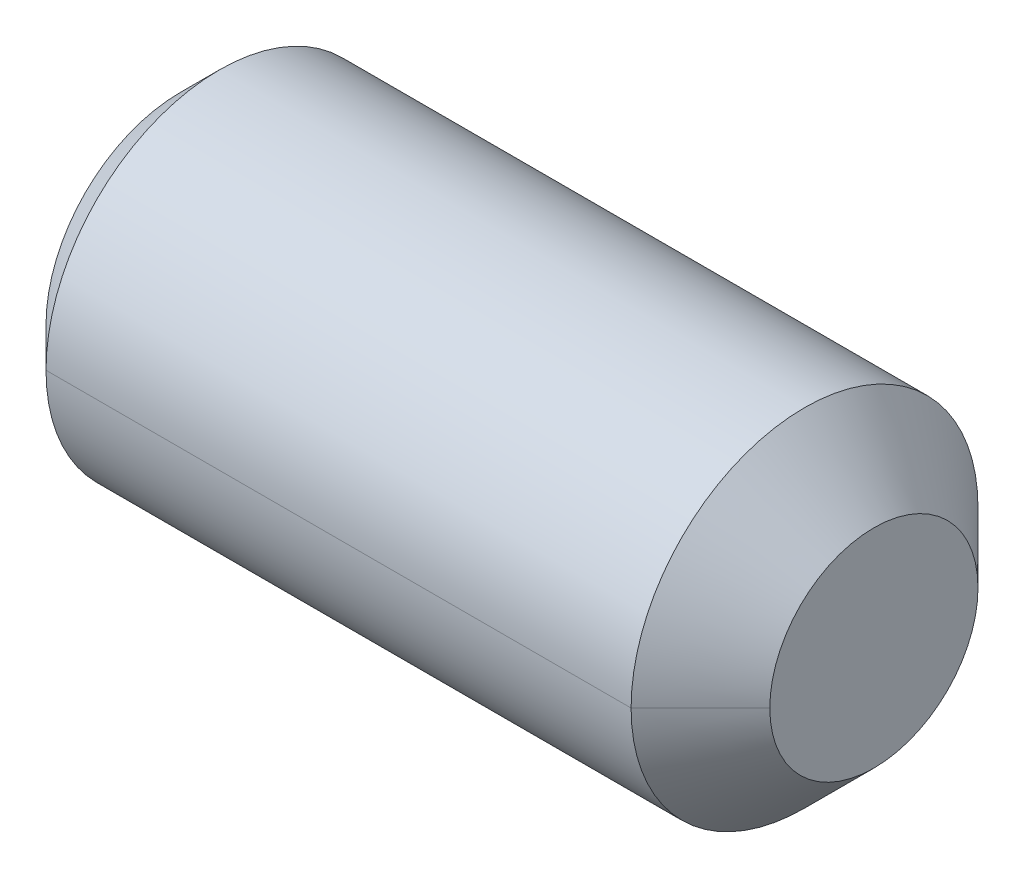
ISO-10303-21;
HEADER;
FILE_DESCRIPTION(('STEP AP214'),'2;1');
FILE_NAME('part.step','',(''),(''),'','','');
FILE_SCHEMA(('AUTOMOTIVE_DESIGN { 1 0 10303 214 1 1 1 1 }'));
ENDSEC;
DATA;
#1=APPLICATION_CONTEXT('core data for automotive mechanical design processes');
#2=APPLICATION_PROTOCOL_DEFINITION('international standard','automotive_design',2000,#1);
#3=PRODUCT_CONTEXT('',#1,'mechanical');
#4=PRODUCT('Part','Part','',(#3));
#5=PRODUCT_RELATED_PRODUCT_CATEGORY('part','',(#4));
#6=PRODUCT_DEFINITION_FORMATION('','',#4);
#7=PRODUCT_DEFINITION_CONTEXT('part definition',#1,'design');
#8=PRODUCT_DEFINITION('design','',#6,#7);
#9=PRODUCT_DEFINITION_SHAPE('','',#8);
#10=(LENGTH_UNIT() NAMED_UNIT(*) SI_UNIT(.MILLI.,.METRE.));
#11=(NAMED_UNIT(*) PLANE_ANGLE_UNIT() SI_UNIT($,.RADIAN.));
#12=(NAMED_UNIT(*) SI_UNIT($,.STERADIAN.) SOLID_ANGLE_UNIT());
#13=UNCERTAINTY_MEASURE_WITH_UNIT(LENGTH_MEASURE(1.E-05),#10,'distance_accuracy_value','');
#14=(GEOMETRIC_REPRESENTATION_CONTEXT(3) GLOBAL_UNCERTAINTY_ASSIGNED_CONTEXT((#13)) GLOBAL_UNIT_ASSIGNED_CONTEXT((#10,
#11,#12)) REPRESENTATION_CONTEXT('',''));
#15=CARTESIAN_POINT('',(0.,0.,0.));
#16=DIRECTION('',(0.,0.,1.));
#17=DIRECTION('',(1.,0.,0.));
#18=AXIS2_PLACEMENT_3D('',#15,#16,#17);
#19=CARTESIAN_POINT('',(-6.4212,0.,0.));
#20=DIRECTION('',(-1.,0.,0.));
#21=DIRECTION('',(0.,1.,0.));
#22=AXIS2_PLACEMENT_3D('',#19,#20,#21);
#23=CONICAL_SURFACE('',#22,0.992,1.0471975512);
#24=CARTESIAN_POINT('',(-5.84846853296839,0.,0.));
#25=DIRECTION('',(-0.499999999997054,0.,-0.86602540378614));
#26=VECTOR('',#25,1.);
#27=LINE('',#24,#26);
#28=CARTESIAN_POINT('',(-5.8484685329639,0.,0.));
#29=VERTEX_POINT('',#28);
#30=CARTESIAN_POINT('',(-6.4212,0.,-0.992));
#31=VERTEX_POINT('',#30);
#32=EDGE_CURVE('E11',#29,#31,#27,.T.);
#33=ORIENTED_EDGE('',*,*,#32,.T.);
#34=CARTESIAN_POINT('',(-6.4212,0.,0.));
#35=DIRECTION('',(1.,0.,0.));
#36=DIRECTION('',(0.,0.,-1.));
#37=AXIS2_PLACEMENT_3D('',#34,#35,#36);
#38=CIRCLE('',#37,0.992);
#39=CARTESIAN_POINT('',(-6.4212,-0.85909720055417,-0.495999999999988));
#40=VERTEX_POINT('',#39);
#41=EDGE_CURVE('E25',#40,#31,#38,.T.);
#42=ORIENTED_EDGE('',*,*,#41,.F.);
#43=CARTESIAN_POINT('',(-6.4212,0.,0.));
#44=DIRECTION('',(1.,0.,0.));
#45=DIRECTION('',(0.,0.,-1.));
#46=AXIS2_PLACEMENT_3D('',#43,#44,#45);
#47=CIRCLE('',#46,0.992);
#48=CARTESIAN_POINT('',(-6.4212,-0.85909720055417,0.495999999999988));
#49=VERTEX_POINT('',#48);
#50=EDGE_CURVE('E451',#49,#40,#47,.T.);
#51=ORIENTED_EDGE('',*,*,#50,.F.);
#52=CARTESIAN_POINT('',(-6.4212,0.,0.));
#53=DIRECTION('',(1.,0.,0.));
#54=DIRECTION('',(0.,0.,-1.));
#55=AXIS2_PLACEMENT_3D('',#52,#53,#54);
#56=CIRCLE('',#55,0.992);
#57=CARTESIAN_POINT('',(-6.4212,0.,0.992));
#58=VERTEX_POINT('',#57);
#59=EDGE_CURVE('E448',#58,#49,#56,.T.);
#60=ORIENTED_EDGE('',*,*,#59,.F.);
#61=CARTESIAN_POINT('',(-5.84846853296839,0.,0.));
#62=DIRECTION('',(-0.499999999997054,0.,0.86602540378614));
#63=VECTOR('',#62,1.);
#64=LINE('',#61,#63);
#65=EDGE_CURVE('E438',#29,#58,#64,.T.);
#66=ORIENTED_EDGE('',*,*,#65,.F.);
#67=EDGE_LOOP('',(#33,#42,#51,#60,#66));
#68=FACE_BOUND('',#67,.T.);
#69=ADVANCED_FACE('F17',(#68),#23,.F.);
#70=CARTESIAN_POINT('',(-6.4212,0.,0.));
#71=DIRECTION('',(-1.,0.,0.));
#72=DIRECTION('',(0.,-1.,0.));
#73=AXIS2_PLACEMENT_3D('',#70,#71,#72);
#74=CONICAL_SURFACE('',#73,0.992,1.0471975512);
#75=ORIENTED_EDGE('',*,*,#65,.T.);
#76=CARTESIAN_POINT('',(-6.4212,0.,0.));
#77=DIRECTION('',(1.,0.,0.));
#78=DIRECTION('',(0.,0.,-1.));
#79=AXIS2_PLACEMENT_3D('',#76,#77,#78);
#80=CIRCLE('',#79,0.992);
#81=CARTESIAN_POINT('',(-6.4212,0.85909720055417,0.495999999999988));
#82=VERTEX_POINT('',#81);
#83=EDGE_CURVE('E490',#82,#58,#80,.T.);
#84=ORIENTED_EDGE('',*,*,#83,.F.);
#85=CARTESIAN_POINT('',(-6.4212,0.,0.));
#86=DIRECTION('',(1.,0.,0.));
#87=DIRECTION('',(0.,0.,-1.));
#88=AXIS2_PLACEMENT_3D('',#85,#86,#87);
#89=CIRCLE('',#88,0.992);
#90=CARTESIAN_POINT('',(-6.4212,0.859097200554164,-0.495999999999984));
#91=VERTEX_POINT('',#90);
#92=EDGE_CURVE('E493',#91,#82,#89,.T.);
#93=ORIENTED_EDGE('',*,*,#92,.F.);
#94=CARTESIAN_POINT('',(-6.4212,0.,0.));
#95=DIRECTION('',(1.,0.,0.));
#96=DIRECTION('',(0.,0.,-1.));
#97=AXIS2_PLACEMENT_3D('',#94,#95,#96);
#98=CIRCLE('',#97,0.992);
#99=EDGE_CURVE('E404',#31,#91,#98,.T.);
#100=ORIENTED_EDGE('',*,*,#99,.F.);
#101=ORIENTED_EDGE('',*,*,#32,.F.);
#102=EDGE_LOOP('',(#75,#84,#93,#100,#101));
#103=FACE_BOUND('',#102,.T.);
#104=ADVANCED_FACE('F411',(#103),#74,.F.);
#105=CARTESIAN_POINT('',(-6.4212,0.,0.));
#106=DIRECTION('',(1.,0.,0.));
#107=DIRECTION('',(0.,0.,-1.));
#108=AXIS2_PLACEMENT_3D('',#105,#106,#107);
#109=PLANE('',#108);
#110=ORIENTED_EDGE('',*,*,#99,.T.);
#111=DIRECTION('',(0.,0.499999999999988,0.866025403784446));
#112=VECTOR('',#111,1.);
#113=CARTESIAN_POINT('',(-6.4212,0.57273146703611,-0.992));
#114=LINE('',#113,#112);
#115=CARTESIAN_POINT('',(-6.4212,0.57273146703611,-0.992));
#116=VERTEX_POINT('',#115);
#117=EDGE_CURVE('E399',#116,#91,#114,.T.);
#118=ORIENTED_EDGE('',*,*,#117,.F.);
#119=DIRECTION('',(0.,1.,0.));
#120=VECTOR('',#119,1.);
#121=CARTESIAN_POINT('',(-6.4212,-0.57273146703611,-0.992));
#122=LINE('',#121,#120);
#123=EDGE_CURVE('E394',#31,#116,#122,.T.);
#124=ORIENTED_EDGE('',*,*,#123,.F.);
#125=EDGE_LOOP('',(#110,#118,#124));
#126=FACE_BOUND('',#125,.T.);
#127=ADVANCED_FACE('F420',(#126),#109,.F.);
#128=CARTESIAN_POINT('',(-6.4212,-0.57273146703611,-0.992));
#129=DIRECTION('',(0.,0.,1.));
#130=DIRECTION('',(1.,0.,0.));
#131=AXIS2_PLACEMENT_3D('',#128,#129,#130);
#132=PLANE('',#131);
#133=DIRECTION('',(0.,1.,0.));
#134=VECTOR('',#133,1.);
#135=CARTESIAN_POINT('',(-8.3312,-0.57273146703611,-0.992));
#136=LINE('',#135,#134);
#137=CARTESIAN_POINT('',(-8.3312,-0.57273146703611,-0.992));
#138=VERTEX_POINT('',#137);
#139=CARTESIAN_POINT('',(-8.3312,0.57273146703611,-0.992));
#140=VERTEX_POINT('',#139);
#141=EDGE_CURVE('E389',#138,#140,#136,.T.);
#142=ORIENTED_EDGE('',*,*,#141,.F.);
#143=DIRECTION('',(-1.,0.,0.));
#144=VECTOR('',#143,1.);
#145=CARTESIAN_POINT('',(-6.4212,-0.57273146703611,-0.992));
#146=LINE('',#145,#144);
#147=CARTESIAN_POINT('',(-6.4212,-0.57273146703611,-0.992));
#148=VERTEX_POINT('',#147);
#149=EDGE_CURVE('E384',#148,#138,#146,.T.);
#150=ORIENTED_EDGE('',*,*,#149,.F.);
#151=DIRECTION('',(0.,1.,0.));
#152=VECTOR('',#151,1.);
#153=CARTESIAN_POINT('',(-6.4212,-0.57273146703611,-0.992));
#154=LINE('',#153,#152);
#155=EDGE_CURVE('E379',#148,#31,#154,.T.);
#156=ORIENTED_EDGE('',*,*,#155,.T.);
#157=ORIENTED_EDGE('',*,*,#123,.T.);
#158=DIRECTION('',(-1.,0.,0.));
#159=VECTOR('',#158,1.);
#160=CARTESIAN_POINT('',(-6.4212,0.57273146703611,-0.992));
#161=LINE('',#160,#159);
#162=EDGE_CURVE('E375',#116,#140,#161,.T.);
#163=ORIENTED_EDGE('',*,*,#162,.T.);
#164=EDGE_LOOP('',(#142,#150,#156,#157,#163));
#165=FACE_BOUND('',#164,.T.);
#166=ADVANCED_FACE('F518',(#165),#132,.T.);
#167=CARTESIAN_POINT('',(-6.4212,0.57273146703611,-0.992));
#168=DIRECTION('',(0.,-0.866025403784446,0.499999999999988));
#169=DIRECTION('',(0.,-0.499999999999988,-0.866025403784446));
#170=AXIS2_PLACEMENT_3D('',#167,#168,#169);
#171=PLANE('',#170);
#172=DIRECTION('',(0.,0.499999999999988,0.866025403784446));
#173=VECTOR('',#172,1.);
#174=CARTESIAN_POINT('',(-8.3312,0.57273146703611,-0.992));
#175=LINE('',#174,#173);
#176=CARTESIAN_POINT('',(-8.3312,1.1454629340722,0.));
#177=VERTEX_POINT('',#176);
#178=EDGE_CURVE('E370',#140,#177,#175,.T.);
#179=ORIENTED_EDGE('',*,*,#178,.F.);
#180=ORIENTED_EDGE('',*,*,#162,.F.);
#181=ORIENTED_EDGE('',*,*,#117,.T.);
#182=DIRECTION('',(0.,0.499999999999988,0.866025403784446));
#183=VECTOR('',#182,1.);
#184=CARTESIAN_POINT('',(-6.4212,0.57273146703611,-0.992));
#185=LINE('',#184,#183);
#186=CARTESIAN_POINT('',(-6.4212,1.1454629340722,0.));
#187=VERTEX_POINT('',#186);
#188=EDGE_CURVE('E366',#91,#187,#185,.T.);
#189=ORIENTED_EDGE('',*,*,#188,.T.);
#190=DIRECTION('',(-1.,0.,0.));
#191=VECTOR('',#190,1.);
#192=CARTESIAN_POINT('',(-6.4212,1.1454629340722,0.));
#193=LINE('',#192,#191);
#194=EDGE_CURVE('E362',#187,#177,#193,.T.);
#195=ORIENTED_EDGE('',*,*,#194,.T.);
#196=EDGE_LOOP('',(#179,#180,#181,#189,#195));
#197=FACE_BOUND('',#196,.T.);
#198=ADVANCED_FACE('F506',(#197),#171,.T.);
#199=CARTESIAN_POINT('',(-6.4212,1.1454629340722,0.));
#200=DIRECTION('',(0.,-0.866025403784446,-0.499999999999988));
#201=DIRECTION('',(0.,0.499999999999988,-0.866025403784446));
#202=AXIS2_PLACEMENT_3D('',#199,#200,#201);
#203=PLANE('',#202);
#204=DIRECTION('',(0.,-0.499999999999988,0.866025403784446));
#205=VECTOR('',#204,1.);
#206=CARTESIAN_POINT('',(-8.3312,1.1454629340722,0.));
#207=LINE('',#206,#205);
#208=CARTESIAN_POINT('',(-8.3312,0.57273146703611,0.992));
#209=VERTEX_POINT('',#208);
#210=EDGE_CURVE('E357',#177,#209,#207,.T.);
#211=ORIENTED_EDGE('',*,*,#210,.F.);
#212=ORIENTED_EDGE('',*,*,#194,.F.);
#213=DIRECTION('',(0.,-0.499999999999988,0.866025403784446));
#214=VECTOR('',#213,1.);
#215=CARTESIAN_POINT('',(-6.4212,1.1454629340722,0.));
#216=LINE('',#215,#214);
#217=EDGE_CURVE('E352',#187,#82,#216,.T.);
#218=ORIENTED_EDGE('',*,*,#217,.T.);
#219=DIRECTION('',(0.,-0.499999999999988,0.866025403784446));
#220=VECTOR('',#219,1.);
#221=CARTESIAN_POINT('',(-6.4212,1.1454629340722,0.));
#222=LINE('',#221,#220);
#223=CARTESIAN_POINT('',(-6.4212,0.57273146703611,0.992));
#224=VERTEX_POINT('',#223);
#225=EDGE_CURVE('E348',#82,#224,#222,.T.);
#226=ORIENTED_EDGE('',*,*,#225,.T.);
#227=DIRECTION('',(-1.,0.,0.));
#228=VECTOR('',#227,1.);
#229=CARTESIAN_POINT('',(-6.4212,0.57273146703611,0.992));
#230=LINE('',#229,#228);
#231=EDGE_CURVE('E344',#224,#209,#230,.T.);
#232=ORIENTED_EDGE('',*,*,#231,.T.);
#233=EDGE_LOOP('',(#211,#212,#218,#226,#232));
#234=FACE_BOUND('',#233,.T.);
#235=ADVANCED_FACE('F513',(#234),#203,.T.);
#236=CARTESIAN_POINT('',(-6.4212,0.57273146703611,0.992));
#237=DIRECTION('',(0.,0.,-1.));
#238=DIRECTION('',(-1.,0.,0.));
#239=AXIS2_PLACEMENT_3D('',#236,#237,#238);
#240=PLANE('',#239);
#241=DIRECTION('',(0.,-1.,0.));
#242=VECTOR('',#241,1.);
#243=CARTESIAN_POINT('',(-8.3312,0.57273146703611,0.992));
#244=LINE('',#243,#242);
#245=CARTESIAN_POINT('',(-8.3312,-0.57273146703611,0.992));
#246=VERTEX_POINT('',#245);
#247=EDGE_CURVE('E339',#209,#246,#244,.T.);
#248=ORIENTED_EDGE('',*,*,#247,.F.);
#249=ORIENTED_EDGE('',*,*,#231,.F.);
#250=DIRECTION('',(0.,-1.,0.));
#251=VECTOR('',#250,1.);
#252=CARTESIAN_POINT('',(-6.4212,0.57273146703611,0.992));
#253=LINE('',#252,#251);
#254=EDGE_CURVE('E334',#224,#58,#253,.T.);
#255=ORIENTED_EDGE('',*,*,#254,.T.);
#256=DIRECTION('',(0.,-1.,0.));
#257=VECTOR('',#256,1.);
#258=CARTESIAN_POINT('',(-6.4212,0.57273146703611,0.992));
#259=LINE('',#258,#257);
#260=CARTESIAN_POINT('',(-6.4212,-0.57273146703611,0.992));
#261=VERTEX_POINT('',#260);
#262=EDGE_CURVE('E330',#58,#261,#259,.T.);
#263=ORIENTED_EDGE('',*,*,#262,.T.);
#264=DIRECTION('',(-1.,0.,0.));
#265=VECTOR('',#264,1.);
#266=CARTESIAN_POINT('',(-6.4212,-0.57273146703611,0.992));
#267=LINE('',#266,#265);
#268=EDGE_CURVE('E326',#261,#246,#267,.T.);
#269=ORIENTED_EDGE('',*,*,#268,.T.);
#270=EDGE_LOOP('',(#248,#249,#255,#263,#269));
#271=FACE_BOUND('',#270,.T.);
#272=ADVANCED_FACE('F521',(#271),#240,.T.);
#273=CARTESIAN_POINT('',(-6.4212,-0.57273146703611,0.992));
#274=DIRECTION('',(0.,0.866025403784446,-0.499999999999988));
#275=DIRECTION('',(0.,0.499999999999988,0.866025403784446));
#276=AXIS2_PLACEMENT_3D('',#273,#274,#275);
#277=PLANE('',#276);
#278=DIRECTION('',(0.,-0.499999999999988,-0.866025403784446));
#279=VECTOR('',#278,1.);
#280=CARTESIAN_POINT('',(-8.3312,-0.57273146703611,0.992));
#281=LINE('',#280,#279);
#282=CARTESIAN_POINT('',(-8.3312,-1.1454629340722,0.));
#283=VERTEX_POINT('',#282);
#284=EDGE_CURVE('E321',#246,#283,#281,.T.);
#285=ORIENTED_EDGE('',*,*,#284,.F.);
#286=ORIENTED_EDGE('',*,*,#268,.F.);
#287=DIRECTION('',(0.,-0.499999999999988,-0.866025403784446));
#288=VECTOR('',#287,1.);
#289=CARTESIAN_POINT('',(-6.4212,-0.57273146703611,0.992));
#290=LINE('',#289,#288);
#291=EDGE_CURVE('E316',#261,#49,#290,.T.);
#292=ORIENTED_EDGE('',*,*,#291,.T.);
#293=DIRECTION('',(0.,-0.499999999999988,-0.866025403784446));
#294=VECTOR('',#293,1.);
#295=CARTESIAN_POINT('',(-6.4212,-0.57273146703611,0.992));
#296=LINE('',#295,#294);
#297=CARTESIAN_POINT('',(-6.4212,-1.1454629340722,0.));
#298=VERTEX_POINT('',#297);
#299=EDGE_CURVE('E312',#49,#298,#296,.T.);
#300=ORIENTED_EDGE('',*,*,#299,.T.);
#301=DIRECTION('',(-1.,0.,0.));
#302=VECTOR('',#301,1.);
#303=CARTESIAN_POINT('',(-6.4212,-1.1454629340722,0.));
#304=LINE('',#303,#302);
#305=EDGE_CURVE('E308',#298,#283,#304,.T.);
#306=ORIENTED_EDGE('',*,*,#305,.T.);
#307=EDGE_LOOP('',(#285,#286,#292,#300,#306));
#308=FACE_BOUND('',#307,.T.);
#309=ADVANCED_FACE('F480',(#308),#277,.T.);
#310=CARTESIAN_POINT('',(-6.4212,-1.1454629340722,0.));
#311=DIRECTION('',(0.,0.866025403784446,0.499999999999988));
#312=DIRECTION('',(0.,-0.499999999999988,0.866025403784446));
#313=AXIS2_PLACEMENT_3D('',#310,#311,#312);
#314=PLANE('',#313);
#315=DIRECTION('',(0.,0.499999999999988,-0.866025403784446));
#316=VECTOR('',#315,1.);
#317=CARTESIAN_POINT('',(-8.3312,-1.1454629340722,0.));
#318=LINE('',#317,#316);
#319=EDGE_CURVE('E303',#283,#138,#318,.T.);
#320=ORIENTED_EDGE('',*,*,#319,.F.);
#321=ORIENTED_EDGE('',*,*,#305,.F.);
#322=DIRECTION('',(0.,0.499999999999988,-0.866025403784446));
#323=VECTOR('',#322,1.);
#324=CARTESIAN_POINT('',(-6.4212,-1.1454629340722,0.));
#325=LINE('',#324,#323);
#326=EDGE_CURVE('E299',#298,#40,#325,.T.);
#327=ORIENTED_EDGE('',*,*,#326,.T.);
#328=DIRECTION('',(0.,0.499999999999988,-0.866025403784446));
#329=VECTOR('',#328,1.);
#330=CARTESIAN_POINT('',(-6.4212,-1.1454629340722,0.));
#331=LINE('',#330,#329);
#332=EDGE_CURVE('E294',#40,#148,#331,.T.);
#333=ORIENTED_EDGE('',*,*,#332,.T.);
#334=ORIENTED_EDGE('',*,*,#149,.T.);
#335=EDGE_LOOP('',(#320,#321,#327,#333,#334));
#336=FACE_BOUND('',#335,.T.);
#337=ADVANCED_FACE('F519',(#336),#314,.T.);
#338=CARTESIAN_POINT('',(-6.4212,0.,0.));
#339=DIRECTION('',(1.,0.,0.));
#340=DIRECTION('',(0.,0.,-1.));
#341=AXIS2_PLACEMENT_3D('',#338,#339,#340);
#342=PLANE('',#341);
#343=ORIENTED_EDGE('',*,*,#41,.T.);
#344=ORIENTED_EDGE('',*,*,#155,.F.);
#345=ORIENTED_EDGE('',*,*,#332,.F.);
#346=EDGE_LOOP('',(#343,#344,#345));
#347=FACE_BOUND('',#346,.T.);
#348=ADVANCED_FACE('F470',(#347),#342,.F.);
#349=CARTESIAN_POINT('',(-6.4212,0.,0.));
#350=DIRECTION('',(1.,0.,0.));
#351=DIRECTION('',(0.,0.,-1.));
#352=AXIS2_PLACEMENT_3D('',#349,#350,#351);
#353=PLANE('',#352);
#354=ORIENTED_EDGE('',*,*,#50,.T.);
#355=ORIENTED_EDGE('',*,*,#326,.F.);
#356=ORIENTED_EDGE('',*,*,#299,.F.);
#357=EDGE_LOOP('',(#354,#355,#356));
#358=FACE_BOUND('',#357,.T.);
#359=ADVANCED_FACE('F475',(#358),#353,.F.);
#360=CARTESIAN_POINT('',(-8.3312,0.,0.));
#361=DIRECTION('',(1.,0.,0.));
#362=DIRECTION('',(0.,0.,-1.));
#363=AXIS2_PLACEMENT_3D('',#360,#361,#362);
#364=PLANE('',#363);
#365=CARTESIAN_POINT('',(-8.3312,0.,0.));
#366=DIRECTION('',(1.,0.,0.));
#367=DIRECTION('',(0.,0.,-1.));
#368=AXIS2_PLACEMENT_3D('',#365,#366,#367);
#369=CIRCLE('',#368,1.61036);
#370=CARTESIAN_POINT('',(-8.3312,0.,-1.61036));
#371=VERTEX_POINT('',#370);
#372=CARTESIAN_POINT('',(-8.3312,0.,1.61036));
#373=VERTEX_POINT('',#372);
#374=EDGE_CURVE('E290',#371,#373,#369,.T.);
#375=ORIENTED_EDGE('',*,*,#374,.F.);
#376=CARTESIAN_POINT('',(-8.3312,0.,0.));
#377=DIRECTION('',(1.,0.,0.));
#378=DIRECTION('',(0.,0.,-1.));
#379=AXIS2_PLACEMENT_3D('',#376,#377,#378);
#380=CIRCLE('',#379,1.61036);
#381=EDGE_CURVE('E288',#373,#371,#380,.T.);
#382=ORIENTED_EDGE('',*,*,#381,.F.);
#383=EDGE_LOOP('',(#375,#382));
#384=FACE_BOUND('',#383,.T.);
#385=ORIENTED_EDGE('',*,*,#247,.T.);
#386=ORIENTED_EDGE('',*,*,#284,.T.);
#387=ORIENTED_EDGE('',*,*,#319,.T.);
#388=ORIENTED_EDGE('',*,*,#141,.T.);
#389=ORIENTED_EDGE('',*,*,#178,.T.);
#390=ORIENTED_EDGE('',*,*,#210,.T.);
#391=EDGE_LOOP('',(#385,#386,#387,#388,#389,#390));
#392=FACE_BOUND('',#391,.T.);
#393=ADVANCED_FACE('F271',(#384,#392),#364,.F.);
#394=CARTESIAN_POINT('',(-8.3312,0.,0.));
#395=DIRECTION('',(1.,0.,0.));
#396=DIRECTION('',(0.,1.,0.));
#397=AXIS2_PLACEMENT_3D('',#394,#395,#396);
#398=CONICAL_SURFACE('',#397,1.61036,0.7853981634);
#399=ORIENTED_EDGE('',*,*,#381,.T.);
#400=CARTESIAN_POINT('',(-8.3312,0.,-1.61036));
#401=DIRECTION('',(0.707106781184744,0.,-0.707106781188351));
#402=VECTOR('',#401,1.);
#403=LINE('',#400,#402);
#404=CARTESIAN_POINT('',(-7.85876,0.,-2.0828));
#405=VERTEX_POINT('',#404);
#406=EDGE_CURVE('E254',#371,#405,#403,.T.);
#407=ORIENTED_EDGE('',*,*,#406,.T.);
#408=CARTESIAN_POINT('',(-7.85876,0.,0.));
#409=DIRECTION('',(1.,0.,0.));
#410=DIRECTION('',(0.,0.,-1.));
#411=AXIS2_PLACEMENT_3D('',#408,#409,#410);
#412=CIRCLE('',#411,2.0828);
#413=CARTESIAN_POINT('',(-7.85876,0.,2.0828));
#414=VERTEX_POINT('',#413);
#415=EDGE_CURVE('E737',#414,#405,#412,.T.);
#416=ORIENTED_EDGE('',*,*,#415,.F.);
#417=CARTESIAN_POINT('',(-8.3312,0.,1.61036));
#418=DIRECTION('',(0.707106781184744,0.,0.707106781188351));
#419=VECTOR('',#418,1.);
#420=LINE('',#417,#419);
#421=EDGE_CURVE('E243',#373,#414,#420,.T.);
#422=ORIENTED_EDGE('',*,*,#421,.F.);
#423=EDGE_LOOP('',(#399,#407,#416,#422));
#424=FACE_BOUND('',#423,.T.);
#425=ADVANCED_FACE('F262',(#424),#398,.T.);
#426=CARTESIAN_POINT('',(-8.3312,0.,0.));
#427=DIRECTION('',(1.,0.,0.));
#428=DIRECTION('',(0.,-1.,0.));
#429=AXIS2_PLACEMENT_3D('',#426,#427,#428);
#430=CONICAL_SURFACE('',#429,1.61036,0.7853981634);
#431=CARTESIAN_POINT('',(-7.85876,0.,0.));
#432=DIRECTION('',(1.,0.,0.));
#433=DIRECTION('',(0.,0.,-1.));
#434=AXIS2_PLACEMENT_3D('',#431,#432,#433);
#435=CIRCLE('',#434,2.0828);
#436=EDGE_CURVE('E226',#405,#414,#435,.T.);
#437=ORIENTED_EDGE('',*,*,#436,.F.);
#438=ORIENTED_EDGE('',*,*,#406,.F.);
#439=ORIENTED_EDGE('',*,*,#374,.T.);
#440=ORIENTED_EDGE('',*,*,#421,.T.);
#441=EDGE_LOOP('',(#437,#438,#439,#440));
#442=FACE_BOUND('',#441,.T.);
#443=ADVANCED_FACE('F210',(#442),#430,.T.);
#444=CARTESIAN_POINT('',(0.,0.,0.));
#445=DIRECTION('',(-1.,0.,0.));
#446=DIRECTION('',(0.,-1.,0.));
#447=AXIS2_PLACEMENT_3D('',#444,#445,#446);
#448=CYLINDRICAL_SURFACE('',#447,2.0828);
#449=CARTESIAN_POINT('',(-0.832800000000001,0.,0.));
#450=DIRECTION('',(1.,0.,0.));
#451=DIRECTION('',(0.,0.,-1.));
#452=AXIS2_PLACEMENT_3D('',#449,#450,#451);
#453=CIRCLE('',#452,2.0828);
#454=CARTESIAN_POINT('',(-0.832800000000001,0.,-2.0828));
#455=VERTEX_POINT('',#454);
#456=CARTESIAN_POINT('',(-0.832800000000001,0.,2.0828));
#457=VERTEX_POINT('',#456);
#458=EDGE_CURVE('E129',#455,#457,#453,.T.);
#459=ORIENTED_EDGE('',*,*,#458,.F.);
#460=CARTESIAN_POINT('',(-0.832800000000001,0.,-2.0828));
#461=DIRECTION('',(-1.,0.,0.));
#462=VECTOR('',#461,1.);
#463=LINE('',#460,#462);
#464=EDGE_CURVE('E196',#455,#405,#463,.T.);
#465=ORIENTED_EDGE('',*,*,#464,.T.);
#466=ORIENTED_EDGE('',*,*,#436,.T.);
#467=CARTESIAN_POINT('',(-0.832800000000001,0.,2.0828));
#468=DIRECTION('',(-1.,0.,0.));
#469=VECTOR('',#468,1.);
#470=LINE('',#467,#469);
#471=EDGE_CURVE('E180',#457,#414,#470,.T.);
#472=ORIENTED_EDGE('',*,*,#471,.F.);
#473=EDGE_LOOP('',(#459,#465,#466,#472));
#474=FACE_BOUND('',#473,.T.);
#475=ADVANCED_FACE('F201',(#474),#448,.T.);
#476=CARTESIAN_POINT('',(0.,0.,0.));
#477=DIRECTION('',(-1.,0.,0.));
#478=DIRECTION('',(0.,1.,0.));
#479=AXIS2_PLACEMENT_3D('',#476,#477,#478);
#480=CYLINDRICAL_SURFACE('',#479,2.0828);
#481=ORIENTED_EDGE('',*,*,#415,.T.);
#482=ORIENTED_EDGE('',*,*,#464,.F.);
#483=CARTESIAN_POINT('',(-0.832800000000001,0.,0.));
#484=DIRECTION('',(1.,0.,0.));
#485=DIRECTION('',(0.,0.,-1.));
#486=AXIS2_PLACEMENT_3D('',#483,#484,#485);
#487=CIRCLE('',#486,2.0828);
#488=EDGE_CURVE('E181',#457,#455,#487,.T.);
#489=ORIENTED_EDGE('',*,*,#488,.F.);
#490=ORIENTED_EDGE('',*,*,#471,.T.);
#491=EDGE_LOOP('',(#481,#482,#489,#490));
#492=FACE_BOUND('',#491,.T.);
#493=ADVANCED_FACE('F150',(#492),#480,.T.);
#494=CARTESIAN_POINT('',(-0.832800000000001,0.,0.));
#495=DIRECTION('',(-1.,0.,0.));
#496=DIRECTION('',(0.,1.,0.));
#497=AXIS2_PLACEMENT_3D('',#494,#495,#496);
#498=CONICAL_SURFACE('',#497,2.0828,0.7853981634);
#499=ORIENTED_EDGE('',*,*,#488,.T.);
#500=CARTESIAN_POINT('',(-2.12514467828884E-12,0.,-1.24999999999787));
#501=DIRECTION('',(-0.707106781184743,0.,-0.707106781188352));
#502=VECTOR('',#501,1.);
#503=LINE('',#500,#502);
#504=CARTESIAN_POINT('',(0.,0.,-1.25));
#505=VERTEX_POINT('',#504);
#506=EDGE_CURVE('E119',#505,#455,#503,.T.);
#507=ORIENTED_EDGE('',*,*,#506,.F.);
#508=CARTESIAN_POINT('',(0.,0.,0.));
#509=DIRECTION('',(1.,0.,0.));
#510=DIRECTION('',(0.,0.,-1.));
#511=AXIS2_PLACEMENT_3D('',#508,#509,#510);
#512=CIRCLE('',#511,1.25);
#513=CARTESIAN_POINT('',(-2.12529993603994E-12,0.,1.24999999999787));
#514=VERTEX_POINT('',#513);
#515=EDGE_CURVE('E111',#514,#505,#512,.T.);
#516=ORIENTED_EDGE('',*,*,#515,.F.);
#517=CARTESIAN_POINT('',(-2.12514467828884E-12,0.,1.24999999999787));
#518=DIRECTION('',(-0.707106781184743,0.,0.707106781188352));
#519=VECTOR('',#518,1.);
#520=LINE('',#517,#519);
#521=EDGE_CURVE('E115',#514,#457,#520,.T.);
#522=ORIENTED_EDGE('',*,*,#521,.T.);
#523=EDGE_LOOP('',(#499,#507,#516,#522));
#524=FACE_BOUND('',#523,.T.);
#525=ADVANCED_FACE('F114',(#524),#498,.T.);
#526=CARTESIAN_POINT('',(-0.832800000000001,0.,0.));
#527=DIRECTION('',(-1.,0.,0.));
#528=DIRECTION('',(0.,-1.,0.));
#529=AXIS2_PLACEMENT_3D('',#526,#527,#528);
#530=CONICAL_SURFACE('',#529,2.0828,0.7853981634);
#531=CARTESIAN_POINT('',(0.,0.,0.));
#532=DIRECTION('',(1.,0.,0.));
#533=DIRECTION('',(0.,0.,-1.));
#534=AXIS2_PLACEMENT_3D('',#531,#532,#533);
#535=CIRCLE('',#534,1.25);
#536=EDGE_CURVE('E128',#505,#514,#535,.T.);
#537=ORIENTED_EDGE('',*,*,#536,.F.);
#538=ORIENTED_EDGE('',*,*,#506,.T.);
#539=ORIENTED_EDGE('',*,*,#458,.T.);
#540=ORIENTED_EDGE('',*,*,#521,.F.);
#541=EDGE_LOOP('',(#537,#538,#539,#540));
#542=FACE_BOUND('',#541,.T.);
#543=ADVANCED_FACE('F127',(#542),#530,.T.);
#544=CARTESIAN_POINT('',(0.,1.25,0.));
#545=DIRECTION('',(-1.,0.,0.));
#546=DIRECTION('',(0.,0.,1.));
#547=AXIS2_PLACEMENT_3D('',#544,#545,#546);
#548=PLANE('',#547);
#549=ORIENTED_EDGE('',*,*,#536,.T.);
#550=ORIENTED_EDGE('',*,*,#515,.T.);
#551=EDGE_LOOP('',(#549,#550));
#552=FACE_BOUND('',#551,.T.);
#553=ADVANCED_FACE('F132',(#552),#548,.F.);
#554=CARTESIAN_POINT('',(-6.4212,0.,0.));
#555=DIRECTION('',(1.,0.,0.));
#556=DIRECTION('',(0.,0.,-1.));
#557=AXIS2_PLACEMENT_3D('',#554,#555,#556);
#558=PLANE('',#557);
#559=ORIENTED_EDGE('',*,*,#59,.T.);
#560=ORIENTED_EDGE('',*,*,#291,.F.);
#561=ORIENTED_EDGE('',*,*,#262,.F.);
#562=EDGE_LOOP('',(#559,#560,#561));
#563=FACE_BOUND('',#562,.T.);
#564=ADVANCED_FACE('F484',(#563),#558,.F.);
#565=CARTESIAN_POINT('',(-6.4212,0.,0.));
#566=DIRECTION('',(1.,0.,0.));
#567=DIRECTION('',(0.,0.,-1.));
#568=AXIS2_PLACEMENT_3D('',#565,#566,#567);
#569=PLANE('',#568);
#570=ORIENTED_EDGE('',*,*,#83,.T.);
#571=ORIENTED_EDGE('',*,*,#254,.F.);
#572=ORIENTED_EDGE('',*,*,#225,.F.);
#573=EDGE_LOOP('',(#570,#571,#572));
#574=FACE_BOUND('',#573,.T.);
#575=ADVANCED_FACE('F491',(#574),#569,.F.);
#576=CARTESIAN_POINT('',(-6.4212,0.,0.));
#577=DIRECTION('',(1.,0.,0.));
#578=DIRECTION('',(0.,0.,-1.));
#579=AXIS2_PLACEMENT_3D('',#576,#577,#578);
#580=PLANE('',#579);
#581=ORIENTED_EDGE('',*,*,#92,.T.);
#582=ORIENTED_EDGE('',*,*,#217,.F.);
#583=ORIENTED_EDGE('',*,*,#188,.F.);
#584=EDGE_LOOP('',(#581,#582,#583));
#585=FACE_BOUND('',#584,.T.);
#586=ADVANCED_FACE('F510',(#585),#580,.F.);
#587=CLOSED_SHELL('',(#69,#104,#127,#166,#198,#235,#272,#309,#337,#348,#359,#393,#425,#443,#475,
#493,#525,#543,#553,#564,#575,#586));
#588=MANIFOLD_SOLID_BREP('B1',#587);
#589=ADVANCED_BREP_SHAPE_REPRESENTATION('',(#18,#588),#14);
#590=SHAPE_DEFINITION_REPRESENTATION(#9,#589);
ENDSEC;
END-ISO-10303-21;
